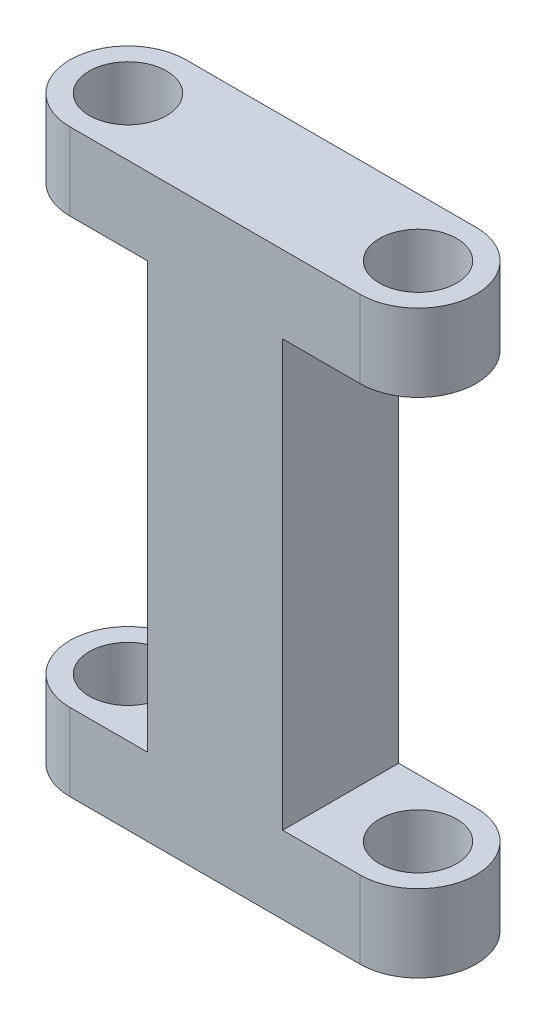
ISO-10303-21;
HEADER;
FILE_DESCRIPTION(('STEP AP214'),'2;1');
FILE_NAME('part.step','',(''),(''),'','','');
FILE_SCHEMA(('AUTOMOTIVE_DESIGN { 1 0 10303 214 1 1 1 1 }'));
ENDSEC;
DATA;
#1=APPLICATION_CONTEXT('core data for automotive mechanical design processes');
#2=APPLICATION_PROTOCOL_DEFINITION('international standard','automotive_design',2000,#1);
#3=PRODUCT_CONTEXT('',#1,'mechanical');
#4=PRODUCT('Part','Part','',(#3));
#5=PRODUCT_RELATED_PRODUCT_CATEGORY('part','',(#4));
#6=PRODUCT_DEFINITION_FORMATION('','',#4);
#7=PRODUCT_DEFINITION_CONTEXT('part definition',#1,'design');
#8=PRODUCT_DEFINITION('design','',#6,#7);
#9=PRODUCT_DEFINITION_SHAPE('','',#8);
#10=(LENGTH_UNIT() NAMED_UNIT(*) SI_UNIT(.MILLI.,.METRE.));
#11=(NAMED_UNIT(*) PLANE_ANGLE_UNIT() SI_UNIT($,.RADIAN.));
#12=(NAMED_UNIT(*) SI_UNIT($,.STERADIAN.) SOLID_ANGLE_UNIT());
#13=UNCERTAINTY_MEASURE_WITH_UNIT(LENGTH_MEASURE(1.E-05),#10,'distance_accuracy_value','');
#14=(GEOMETRIC_REPRESENTATION_CONTEXT(3) GLOBAL_UNCERTAINTY_ASSIGNED_CONTEXT((#13)) GLOBAL_UNIT_ASSIGNED_CONTEXT((#10,
#11,#12)) REPRESENTATION_CONTEXT('',''));
#15=CARTESIAN_POINT('',(0.,0.,0.));
#16=DIRECTION('',(0.,0.,1.));
#17=DIRECTION('',(1.,0.,0.));
#18=AXIS2_PLACEMENT_3D('',#15,#16,#17);
#19=CARTESIAN_POINT('',(-8.53932584269664,30.,0.));
#20=DIRECTION('',(0.,-1.,0.));
#21=DIRECTION('',(0.,0.,-1.));
#22=AXIS2_PLACEMENT_3D('',#19,#20,#21);
#23=CYLINDRICAL_SURFACE('',#22,3.);
#24=DIRECTION('',(0.,-1.,0.));
#25=VECTOR('',#24,1.);
#26=CARTESIAN_POINT('',(-8.53932584269664,30.,-3.));
#27=LINE('',#26,#25);
#28=CARTESIAN_POINT('',(-8.53932584269664,30.,-3.));
#29=VERTEX_POINT('',#28);
#30=CARTESIAN_POINT('',(-8.53932584269664,26.,-3.));
#31=VERTEX_POINT('',#30);
#32=EDGE_CURVE('E139',#29,#31,#27,.T.);
#33=ORIENTED_EDGE('',*,*,#32,.T.);
#34=CARTESIAN_POINT('',(-8.53932584269664,26.,0.));
#35=DIRECTION('',(0.,1.,0.));
#36=DIRECTION('',(0.,0.,1.));
#37=AXIS2_PLACEMENT_3D('',#34,#35,#36);
#38=CIRCLE('',#37,3.);
#39=CARTESIAN_POINT('',(-8.53932584269664,26.,3.));
#40=VERTEX_POINT('',#39);
#41=EDGE_CURVE('E125',#40,#31,#38,.F.);
#42=ORIENTED_EDGE('',*,*,#41,.F.);
#43=DIRECTION('',(0.,-1.,0.));
#44=VECTOR('',#43,1.);
#45=CARTESIAN_POINT('',(-8.53932584269664,30.,3.));
#46=LINE('',#45,#44);
#47=CARTESIAN_POINT('',(-8.53932584269664,30.,3.));
#48=VERTEX_POINT('',#47);
#49=EDGE_CURVE('E11',#48,#40,#46,.T.);
#50=ORIENTED_EDGE('',*,*,#49,.F.);
#51=CARTESIAN_POINT('',(-8.53932584269664,30.,0.));
#52=DIRECTION('',(0.,1.,0.));
#53=DIRECTION('',(0.,0.,1.));
#54=AXIS2_PLACEMENT_3D('',#51,#52,#53);
#55=CIRCLE('',#54,3.);
#56=EDGE_CURVE('E153',#29,#48,#55,.T.);
#57=ORIENTED_EDGE('',*,*,#56,.F.);
#58=EDGE_LOOP('',(#33,#42,#50,#57));
#59=FACE_BOUND('',#58,.T.);
#60=ADVANCED_FACE('F33',(#59),#23,.T.);
#61=CARTESIAN_POINT('',(-8.53932584269664,30.,0.));
#62=DIRECTION('',(0.,-1.,0.));
#63=DIRECTION('',(0.,0.,-1.));
#64=AXIS2_PLACEMENT_3D('',#61,#62,#63);
#65=CYLINDRICAL_SURFACE('',#64,2.);
#66=CARTESIAN_POINT('',(-8.53932584269664,26.,0.));
#67=DIRECTION('',(0.,1.,0.));
#68=DIRECTION('',(0.,0.,1.));
#69=AXIS2_PLACEMENT_3D('',#66,#67,#68);
#70=CIRCLE('',#69,2.);
#71=CARTESIAN_POINT('',(-8.53932584269664,26.,2.));
#72=VERTEX_POINT('',#71);
#73=EDGE_CURVE('E281',#72,#72,#70,.F.);
#74=ORIENTED_EDGE('',*,*,#73,.T.);
#75=EDGE_LOOP('',(#74));
#76=FACE_BOUND('',#75,.T.);
#77=CARTESIAN_POINT('',(-8.53932584269664,30.,0.));
#78=DIRECTION('',(0.,1.,0.));
#79=DIRECTION('',(0.,0.,1.));
#80=AXIS2_PLACEMENT_3D('',#77,#78,#79);
#81=CIRCLE('',#80,2.);
#82=CARTESIAN_POINT('',(-8.53932584269664,30.,2.));
#83=VERTEX_POINT('',#82);
#84=EDGE_CURVE('E175',#83,#83,#81,.T.);
#85=ORIENTED_EDGE('',*,*,#84,.T.);
#86=EDGE_LOOP('',(#85));
#87=FACE_BOUND('',#86,.T.);
#88=ADVANCED_FACE('F251',(#76,#87),#65,.F.);
#89=CARTESIAN_POINT('',(6.46067415730336,30.,0.));
#90=DIRECTION('',(0.,-1.,0.));
#91=DIRECTION('',(0.,0.,-1.));
#92=AXIS2_PLACEMENT_3D('',#89,#90,#91);
#93=CYLINDRICAL_SURFACE('',#92,3.);
#94=DIRECTION('',(0.,-1.,0.));
#95=VECTOR('',#94,1.);
#96=CARTESIAN_POINT('',(6.46067415730336,30.,-3.));
#97=LINE('',#96,#95);
#98=CARTESIAN_POINT('',(6.46067415730336,4.,-3.));
#99=VERTEX_POINT('',#98);
#100=CARTESIAN_POINT('',(6.46067415730336,0.,-3.));
#101=VERTEX_POINT('',#100);
#102=EDGE_CURVE('E181',#99,#101,#97,.T.);
#103=ORIENTED_EDGE('',*,*,#102,.F.);
#104=CARTESIAN_POINT('',(6.46067415730336,4.,0.));
#105=DIRECTION('',(0.,-1.,0.));
#106=DIRECTION('',(1.,0.,0.));
#107=AXIS2_PLACEMENT_3D('',#104,#105,#106);
#108=CIRCLE('',#107,3.);
#109=CARTESIAN_POINT('',(6.46067415730336,4.,3.));
#110=VERTEX_POINT('',#109);
#111=EDGE_CURVE('E194',#110,#99,#108,.F.);
#112=ORIENTED_EDGE('',*,*,#111,.F.);
#113=DIRECTION('',(0.,-1.,0.));
#114=VECTOR('',#113,1.);
#115=CARTESIAN_POINT('',(6.46067415730336,30.,3.));
#116=LINE('',#115,#114);
#117=CARTESIAN_POINT('',(6.46067415730336,0.,3.));
#118=VERTEX_POINT('',#117);
#119=EDGE_CURVE('E184',#110,#118,#116,.T.);
#120=ORIENTED_EDGE('',*,*,#119,.T.);
#121=CARTESIAN_POINT('',(6.46067415730336,0.,0.));
#122=DIRECTION('',(0.,1.,0.));
#123=DIRECTION('',(0.,0.,1.));
#124=AXIS2_PLACEMENT_3D('',#121,#122,#123);
#125=CIRCLE('',#124,3.);
#126=EDGE_CURVE('E162',#118,#101,#125,.T.);
#127=ORIENTED_EDGE('',*,*,#126,.T.);
#128=EDGE_LOOP('',(#103,#112,#120,#127));
#129=FACE_BOUND('',#128,.T.);
#130=ADVANCED_FACE('F191',(#129),#93,.T.);
#131=CARTESIAN_POINT('',(6.46067415730336,30.,0.));
#132=DIRECTION('',(0.,-1.,0.));
#133=DIRECTION('',(0.,0.,-1.));
#134=AXIS2_PLACEMENT_3D('',#131,#132,#133);
#135=CYLINDRICAL_SURFACE('',#134,2.);
#136=CARTESIAN_POINT('',(6.46067415730336,4.,0.));
#137=DIRECTION('',(0.,-1.,0.));
#138=DIRECTION('',(1.,0.,0.));
#139=AXIS2_PLACEMENT_3D('',#136,#137,#138);
#140=CIRCLE('',#139,2.);
#141=CARTESIAN_POINT('',(8.46067415730336,4.,0.));
#142=VERTEX_POINT('',#141);
#143=EDGE_CURVE('E218',#142,#142,#140,.F.);
#144=ORIENTED_EDGE('',*,*,#143,.T.);
#145=EDGE_LOOP('',(#144));
#146=FACE_BOUND('',#145,.T.);
#147=CARTESIAN_POINT('',(6.46067415730336,0.,0.));
#148=DIRECTION('',(0.,1.,0.));
#149=DIRECTION('',(0.,0.,1.));
#150=AXIS2_PLACEMENT_3D('',#147,#148,#149);
#151=CIRCLE('',#150,2.);
#152=CARTESIAN_POINT('',(6.46067415730336,0.,2.));
#153=VERTEX_POINT('',#152);
#154=EDGE_CURVE('E234',#153,#153,#151,.T.);
#155=ORIENTED_EDGE('',*,*,#154,.F.);
#156=EDGE_LOOP('',(#155));
#157=FACE_BOUND('',#156,.T.);
#158=ADVANCED_FACE('F259',(#146,#157),#135,.F.);
#159=CARTESIAN_POINT('',(-8.53932584269664,30.,0.));
#160=DIRECTION('',(0.,1.,0.));
#161=DIRECTION('',(0.,0.,1.));
#162=AXIS2_PLACEMENT_3D('',#159,#160,#161);
#163=PLANE('',#162);
#164=ORIENTED_EDGE('',*,*,#84,.F.);
#165=EDGE_LOOP('',(#164));
#166=FACE_BOUND('',#165,.T.);
#167=ORIENTED_EDGE('',*,*,#56,.T.);
#168=DIRECTION('',(1.,0.,0.));
#169=VECTOR('',#168,1.);
#170=CARTESIAN_POINT('',(-8.53932584269664,30.,3.));
#171=LINE('',#170,#169);
#172=CARTESIAN_POINT('',(6.46067415730336,30.,3.));
#173=VERTEX_POINT('',#172);
#174=EDGE_CURVE('E145',#48,#173,#171,.T.);
#175=ORIENTED_EDGE('',*,*,#174,.T.);
#176=CARTESIAN_POINT('',(6.46067415730336,30.,0.));
#177=DIRECTION('',(0.,1.,0.));
#178=DIRECTION('',(0.,0.,1.));
#179=AXIS2_PLACEMENT_3D('',#176,#177,#178);
#180=CIRCLE('',#179,3.);
#181=CARTESIAN_POINT('',(6.46067415730336,30.,-3.));
#182=VERTEX_POINT('',#181);
#183=EDGE_CURVE('E152',#173,#182,#180,.T.);
#184=ORIENTED_EDGE('',*,*,#183,.T.);
#185=DIRECTION('',(-1.,0.,0.));
#186=VECTOR('',#185,1.);
#187=CARTESIAN_POINT('',(-8.53932584269664,30.,-3.));
#188=LINE('',#187,#186);
#189=EDGE_CURVE('E158',#182,#29,#188,.T.);
#190=ORIENTED_EDGE('',*,*,#189,.T.);
#191=EDGE_LOOP('',(#167,#175,#184,#190));
#192=FACE_BOUND('',#191,.T.);
#193=CARTESIAN_POINT('',(6.46067415730336,30.,0.));
#194=DIRECTION('',(0.,1.,0.));
#195=DIRECTION('',(0.,0.,1.));
#196=AXIS2_PLACEMENT_3D('',#193,#194,#195);
#197=CIRCLE('',#196,2.);
#198=CARTESIAN_POINT('',(6.46067415730336,30.,2.));
#199=VERTEX_POINT('',#198);
#200=EDGE_CURVE('E235',#199,#199,#197,.T.);
#201=ORIENTED_EDGE('',*,*,#200,.F.);
#202=EDGE_LOOP('',(#201));
#203=FACE_BOUND('',#202,.T.);
#204=ADVANCED_FACE('F155',(#166,#192,#203),#163,.T.);
#205=CARTESIAN_POINT('',(-8.53932584269664,0.,0.));
#206=DIRECTION('',(0.,1.,0.));
#207=DIRECTION('',(0.,0.,1.));
#208=AXIS2_PLACEMENT_3D('',#205,#206,#207);
#209=PLANE('',#208);
#210=CARTESIAN_POINT('',(-8.53932584269664,0.,0.));
#211=DIRECTION('',(0.,1.,0.));
#212=DIRECTION('',(0.,0.,1.));
#213=AXIS2_PLACEMENT_3D('',#210,#211,#212);
#214=CIRCLE('',#213,2.);
#215=CARTESIAN_POINT('',(-8.53932584269664,0.,2.));
#216=VERTEX_POINT('',#215);
#217=EDGE_CURVE('E165',#216,#216,#214,.T.);
#218=ORIENTED_EDGE('',*,*,#217,.T.);
#219=EDGE_LOOP('',(#218));
#220=FACE_BOUND('',#219,.T.);
#221=CARTESIAN_POINT('',(-8.53932584269664,0.,0.));
#222=DIRECTION('',(0.,1.,0.));
#223=DIRECTION('',(0.,0.,1.));
#224=AXIS2_PLACEMENT_3D('',#221,#222,#223);
#225=CIRCLE('',#224,3.);
#226=CARTESIAN_POINT('',(-8.53932584269664,0.,-3.));
#227=VERTEX_POINT('',#226);
#228=CARTESIAN_POINT('',(-8.53932584269664,0.,3.));
#229=VERTEX_POINT('',#228);
#230=EDGE_CURVE('E171',#227,#229,#225,.T.);
#231=ORIENTED_EDGE('',*,*,#230,.F.);
#232=DIRECTION('',(-1.,0.,0.));
#233=VECTOR('',#232,1.);
#234=CARTESIAN_POINT('',(-8.53932584269664,0.,-3.));
#235=LINE('',#234,#233);
#236=EDGE_CURVE('E159',#101,#227,#235,.T.);
#237=ORIENTED_EDGE('',*,*,#236,.F.);
#238=ORIENTED_EDGE('',*,*,#126,.F.);
#239=DIRECTION('',(1.,0.,0.));
#240=VECTOR('',#239,1.);
#241=CARTESIAN_POINT('',(-8.53932584269664,0.,3.));
#242=LINE('',#241,#240);
#243=EDGE_CURVE('E174',#229,#118,#242,.T.);
#244=ORIENTED_EDGE('',*,*,#243,.F.);
#245=EDGE_LOOP('',(#231,#237,#238,#244));
#246=FACE_BOUND('',#245,.T.);
#247=ORIENTED_EDGE('',*,*,#154,.T.);
#248=EDGE_LOOP('',(#247));
#249=FACE_BOUND('',#248,.T.);
#250=ADVANCED_FACE('F201',(#220,#246,#249),#209,.F.);
#251=CARTESIAN_POINT('',(-8.53932584269664,4.,3.));
#252=VERTEX_POINT('',#251);
#253=EDGE_CURVE('E41',#252,#229,#46,.T.);
#254=ORIENTED_EDGE('',*,*,#253,.F.);
#255=CARTESIAN_POINT('',(-8.53932584269664,4.,0.));
#256=DIRECTION('',(0.,-1.,0.));
#257=DIRECTION('',(0.,0.,-1.));
#258=AXIS2_PLACEMENT_3D('',#255,#256,#257);
#259=CIRCLE('',#258,3.);
#260=CARTESIAN_POINT('',(-8.53932584269664,4.,-3.));
#261=VERTEX_POINT('',#260);
#262=EDGE_CURVE('E141',#261,#252,#259,.F.);
#263=ORIENTED_EDGE('',*,*,#262,.F.);
#264=EDGE_CURVE('E170',#261,#227,#27,.T.);
#265=ORIENTED_EDGE('',*,*,#264,.T.);
#266=ORIENTED_EDGE('',*,*,#230,.T.);
#267=EDGE_LOOP('',(#254,#263,#265,#266));
#268=FACE_BOUND('',#267,.T.);
#269=ADVANCED_FACE('F35',(#268),#23,.T.);
#270=CARTESIAN_POINT('',(-8.53932584269664,30.,3.));
#271=DIRECTION('',(0.,0.,-1.));
#272=DIRECTION('',(-1.,0.,0.));
#273=AXIS2_PLACEMENT_3D('',#270,#271,#272);
#274=PLANE('',#273);
#275=ORIENTED_EDGE('',*,*,#49,.T.);
#276=DIRECTION('',(-1.,0.,0.));
#277=VECTOR('',#276,1.);
#278=CARTESIAN_POINT('',(-11.5393258426966,26.,3.));
#279=LINE('',#278,#277);
#280=CARTESIAN_POINT('',(-4.53932584269664,26.,3.));
#281=VERTEX_POINT('',#280);
#282=EDGE_CURVE('E121',#281,#40,#279,.T.);
#283=ORIENTED_EDGE('',*,*,#282,.F.);
#284=DIRECTION('',(0.,1.,0.));
#285=VECTOR('',#284,1.);
#286=CARTESIAN_POINT('',(-4.53932584269664,26.,3.));
#287=LINE('',#286,#285);
#288=CARTESIAN_POINT('',(-4.53932584269664,4.,3.));
#289=VERTEX_POINT('',#288);
#290=EDGE_CURVE('E132',#289,#281,#287,.T.);
#291=ORIENTED_EDGE('',*,*,#290,.F.);
#292=DIRECTION('',(1.,0.,0.));
#293=VECTOR('',#292,1.);
#294=CARTESIAN_POINT('',(-11.5393258426966,4.,3.));
#295=LINE('',#294,#293);
#296=EDGE_CURVE('E287',#252,#289,#295,.T.);
#297=ORIENTED_EDGE('',*,*,#296,.F.);
#298=ORIENTED_EDGE('',*,*,#253,.T.);
#299=ORIENTED_EDGE('',*,*,#243,.T.);
#300=ORIENTED_EDGE('',*,*,#119,.F.);
#301=DIRECTION('',(1.,0.,0.));
#302=VECTOR('',#301,1.);
#303=CARTESIAN_POINT('',(9.46067415730336,4.,3.));
#304=LINE('',#303,#302);
#305=CARTESIAN_POINT('',(2.46067415730336,4.,3.));
#306=VERTEX_POINT('',#305);
#307=EDGE_CURVE('E224',#306,#110,#304,.T.);
#308=ORIENTED_EDGE('',*,*,#307,.F.);
#309=DIRECTION('',(0.,-1.,0.));
#310=VECTOR('',#309,1.);
#311=CARTESIAN_POINT('',(2.46067415730336,26.,3.));
#312=LINE('',#311,#310);
#313=CARTESIAN_POINT('',(2.46067415730336,26.,3.));
#314=VERTEX_POINT('',#313);
#315=EDGE_CURVE('E216',#314,#306,#312,.T.);
#316=ORIENTED_EDGE('',*,*,#315,.F.);
#317=DIRECTION('',(-1.,0.,0.));
#318=VECTOR('',#317,1.);
#319=CARTESIAN_POINT('',(9.46067415730336,26.,3.));
#320=LINE('',#319,#318);
#321=CARTESIAN_POINT('',(6.46067415730336,26.,3.));
#322=VERTEX_POINT('',#321);
#323=EDGE_CURVE('E214',#322,#314,#320,.T.);
#324=ORIENTED_EDGE('',*,*,#323,.F.);
#325=EDGE_CURVE('E149',#173,#322,#116,.T.);
#326=ORIENTED_EDGE('',*,*,#325,.F.);
#327=ORIENTED_EDGE('',*,*,#174,.F.);
#328=EDGE_LOOP('',(#275,#283,#291,#297,#298,#299,#300,#308,#316,#324,#326,#327));
#329=FACE_BOUND('',#328,.T.);
#330=ADVANCED_FACE('F143',(#329),#274,.F.);
#331=ORIENTED_EDGE('',*,*,#325,.T.);
#332=CARTESIAN_POINT('',(6.46067415730336,26.,0.));
#333=DIRECTION('',(0.,1.,0.));
#334=DIRECTION('',(0.,0.,1.));
#335=AXIS2_PLACEMENT_3D('',#332,#333,#334);
#336=CIRCLE('',#335,3.);
#337=CARTESIAN_POINT('',(6.46067415730336,26.,-3.));
#338=VERTEX_POINT('',#337);
#339=EDGE_CURVE('E295',#338,#322,#336,.F.);
#340=ORIENTED_EDGE('',*,*,#339,.F.);
#341=EDGE_CURVE('E182',#182,#338,#97,.T.);
#342=ORIENTED_EDGE('',*,*,#341,.F.);
#343=ORIENTED_EDGE('',*,*,#183,.F.);
#344=EDGE_LOOP('',(#331,#340,#342,#343));
#345=FACE_BOUND('',#344,.T.);
#346=ADVANCED_FACE('F260',(#345),#93,.T.);
#347=CARTESIAN_POINT('',(-8.53932584269664,30.,-3.));
#348=DIRECTION('',(0.,0.,1.));
#349=DIRECTION('',(1.,0.,0.));
#350=AXIS2_PLACEMENT_3D('',#347,#348,#349);
#351=PLANE('',#350);
#352=DIRECTION('',(0.,-1.,0.));
#353=VECTOR('',#352,1.);
#354=CARTESIAN_POINT('',(-4.53932584269664,26.,-3.));
#355=LINE('',#354,#353);
#356=CARTESIAN_POINT('',(-4.53932584269664,26.,-3.));
#357=VERTEX_POINT('',#356);
#358=CARTESIAN_POINT('',(-4.53932584269664,4.,-3.));
#359=VERTEX_POINT('',#358);
#360=EDGE_CURVE('E48',#357,#359,#355,.T.);
#361=ORIENTED_EDGE('',*,*,#360,.F.);
#362=DIRECTION('',(1.,0.,0.));
#363=VECTOR('',#362,1.);
#364=CARTESIAN_POINT('',(-11.5393258426966,26.,-3.));
#365=LINE('',#364,#363);
#366=EDGE_CURVE('E285',#31,#357,#365,.T.);
#367=ORIENTED_EDGE('',*,*,#366,.F.);
#368=ORIENTED_EDGE('',*,*,#32,.F.);
#369=ORIENTED_EDGE('',*,*,#189,.F.);
#370=ORIENTED_EDGE('',*,*,#341,.T.);
#371=DIRECTION('',(1.,0.,0.));
#372=VECTOR('',#371,1.);
#373=CARTESIAN_POINT('',(9.46067415730336,26.,-3.));
#374=LINE('',#373,#372);
#375=CARTESIAN_POINT('',(2.46067415730336,26.,-3.));
#376=VERTEX_POINT('',#375);
#377=EDGE_CURVE('E228',#376,#338,#374,.T.);
#378=ORIENTED_EDGE('',*,*,#377,.F.);
#379=DIRECTION('',(0.,1.,0.));
#380=VECTOR('',#379,1.);
#381=CARTESIAN_POINT('',(2.46067415730336,26.,-3.));
#382=LINE('',#381,#380);
#383=CARTESIAN_POINT('',(2.46067415730336,4.,-3.));
#384=VERTEX_POINT('',#383);
#385=EDGE_CURVE('E211',#384,#376,#382,.T.);
#386=ORIENTED_EDGE('',*,*,#385,.F.);
#387=DIRECTION('',(-1.,0.,0.));
#388=VECTOR('',#387,1.);
#389=CARTESIAN_POINT('',(9.46067415730336,4.,-3.));
#390=LINE('',#389,#388);
#391=EDGE_CURVE('E209',#99,#384,#390,.T.);
#392=ORIENTED_EDGE('',*,*,#391,.F.);
#393=ORIENTED_EDGE('',*,*,#102,.T.);
#394=ORIENTED_EDGE('',*,*,#236,.T.);
#395=ORIENTED_EDGE('',*,*,#264,.F.);
#396=DIRECTION('',(-1.,0.,0.));
#397=VECTOR('',#396,1.);
#398=CARTESIAN_POINT('',(-11.5393258426966,4.,-3.));
#399=LINE('',#398,#397);
#400=EDGE_CURVE('E291',#359,#261,#399,.T.);
#401=ORIENTED_EDGE('',*,*,#400,.F.);
#402=EDGE_LOOP('',(#361,#367,#368,#369,#370,#378,#386,#392,#393,#394,#395,#401));
#403=FACE_BOUND('',#402,.T.);
#404=ADVANCED_FACE('F205',(#403),#351,.F.);
#405=CARTESIAN_POINT('',(-8.53932584269664,4.,0.));
#406=DIRECTION('',(0.,-1.,0.));
#407=DIRECTION('',(0.,0.,-1.));
#408=AXIS2_PLACEMENT_3D('',#405,#406,#407);
#409=CIRCLE('',#408,2.);
#410=CARTESIAN_POINT('',(-8.53932584269664,4.,-2.));
#411=VERTEX_POINT('',#410);
#412=EDGE_CURVE('E140',#411,#411,#409,.F.);
#413=ORIENTED_EDGE('',*,*,#412,.T.);
#414=EDGE_LOOP('',(#413));
#415=FACE_BOUND('',#414,.T.);
#416=ORIENTED_EDGE('',*,*,#217,.F.);
#417=EDGE_LOOP('',(#416));
#418=FACE_BOUND('',#417,.T.);
#419=ADVANCED_FACE('F246',(#415,#418),#65,.F.);
#420=CARTESIAN_POINT('',(6.46067415730336,26.,0.));
#421=DIRECTION('',(0.,1.,0.));
#422=DIRECTION('',(0.,0.,1.));
#423=AXIS2_PLACEMENT_3D('',#420,#421,#422);
#424=CIRCLE('',#423,2.);
#425=CARTESIAN_POINT('',(6.46067415730336,26.,2.));
#426=VERTEX_POINT('',#425);
#427=EDGE_CURVE('E230',#426,#426,#424,.F.);
#428=ORIENTED_EDGE('',*,*,#427,.T.);
#429=EDGE_LOOP('',(#428));
#430=FACE_BOUND('',#429,.T.);
#431=ORIENTED_EDGE('',*,*,#200,.T.);
#432=EDGE_LOOP('',(#431));
#433=FACE_BOUND('',#432,.T.);
#434=ADVANCED_FACE('F248',(#430,#433),#135,.F.);
#435=CARTESIAN_POINT('',(9.46067415730336,4.,-3.001));
#436=DIRECTION('',(0.,-1.,0.));
#437=DIRECTION('',(1.,0.,0.));
#438=AXIS2_PLACEMENT_3D('',#435,#436,#437);
#439=PLANE('',#438);
#440=ORIENTED_EDGE('',*,*,#143,.F.);
#441=EDGE_LOOP('',(#440));
#442=FACE_BOUND('',#441,.T.);
#443=ORIENTED_EDGE('',*,*,#111,.T.);
#444=ORIENTED_EDGE('',*,*,#391,.T.);
#445=DIRECTION('',(0.,0.,1.));
#446=VECTOR('',#445,1.);
#447=CARTESIAN_POINT('',(2.46067415730336,4.,-3.001));
#448=LINE('',#447,#446);
#449=EDGE_CURVE('E226',#384,#306,#448,.T.);
#450=ORIENTED_EDGE('',*,*,#449,.T.);
#451=ORIENTED_EDGE('',*,*,#307,.T.);
#452=EDGE_LOOP('',(#443,#444,#450,#451));
#453=FACE_BOUND('',#452,.T.);
#454=ADVANCED_FACE('F256',(#442,#453),#439,.F.);
#455=CARTESIAN_POINT('',(2.46067415730336,26.,-3.001));
#456=DIRECTION('',(-1.,0.,0.));
#457=DIRECTION('',(0.,-1.,0.));
#458=AXIS2_PLACEMENT_3D('',#455,#456,#457);
#459=PLANE('',#458);
#460=ORIENTED_EDGE('',*,*,#385,.T.);
#461=DIRECTION('',(0.,0.,1.));
#462=VECTOR('',#461,1.);
#463=CARTESIAN_POINT('',(2.46067415730336,26.,-3.001));
#464=LINE('',#463,#462);
#465=EDGE_CURVE('E56',#376,#314,#464,.T.);
#466=ORIENTED_EDGE('',*,*,#465,.T.);
#467=ORIENTED_EDGE('',*,*,#315,.T.);
#468=ORIENTED_EDGE('',*,*,#449,.F.);
#469=EDGE_LOOP('',(#460,#466,#467,#468));
#470=FACE_BOUND('',#469,.T.);
#471=ADVANCED_FACE('F303',(#470),#459,.F.);
#472=CARTESIAN_POINT('',(9.46067415730336,26.,-3.001));
#473=DIRECTION('',(0.,1.,0.));
#474=DIRECTION('',(0.,0.,1.));
#475=AXIS2_PLACEMENT_3D('',#472,#473,#474);
#476=PLANE('',#475);
#477=ORIENTED_EDGE('',*,*,#427,.F.);
#478=EDGE_LOOP('',(#477));
#479=FACE_BOUND('',#478,.T.);
#480=ORIENTED_EDGE('',*,*,#323,.T.);
#481=ORIENTED_EDGE('',*,*,#465,.F.);
#482=ORIENTED_EDGE('',*,*,#377,.T.);
#483=ORIENTED_EDGE('',*,*,#339,.T.);
#484=EDGE_LOOP('',(#480,#481,#482,#483));
#485=FACE_BOUND('',#484,.T.);
#486=ADVANCED_FACE('F307',(#479,#485),#476,.F.);
#487=CARTESIAN_POINT('',(-11.5393258426966,26.,-3.001));
#488=DIRECTION('',(0.,1.,0.));
#489=DIRECTION('',(0.,0.,1.));
#490=AXIS2_PLACEMENT_3D('',#487,#488,#489);
#491=PLANE('',#490);
#492=ORIENTED_EDGE('',*,*,#73,.F.);
#493=EDGE_LOOP('',(#492));
#494=FACE_BOUND('',#493,.T.);
#495=ORIENTED_EDGE('',*,*,#41,.T.);
#496=ORIENTED_EDGE('',*,*,#366,.T.);
#497=DIRECTION('',(0.,0.,1.));
#498=VECTOR('',#497,1.);
#499=CARTESIAN_POINT('',(-4.53932584269664,26.,-3.001));
#500=LINE('',#499,#498);
#501=EDGE_CURVE('E127',#357,#281,#500,.T.);
#502=ORIENTED_EDGE('',*,*,#501,.T.);
#503=ORIENTED_EDGE('',*,*,#282,.T.);
#504=EDGE_LOOP('',(#495,#496,#502,#503));
#505=FACE_BOUND('',#504,.T.);
#506=ADVANCED_FACE('F123',(#494,#505),#491,.F.);
#507=CARTESIAN_POINT('',(-4.53932584269664,26.,-3.001));
#508=DIRECTION('',(1.,0.,0.));
#509=DIRECTION('',(0.,1.,0.));
#510=AXIS2_PLACEMENT_3D('',#507,#508,#509);
#511=PLANE('',#510);
#512=ORIENTED_EDGE('',*,*,#360,.T.);
#513=DIRECTION('',(0.,0.,1.));
#514=VECTOR('',#513,1.);
#515=CARTESIAN_POINT('',(-4.53932584269664,4.,-3.001));
#516=LINE('',#515,#514);
#517=EDGE_CURVE('E131',#359,#289,#516,.T.);
#518=ORIENTED_EDGE('',*,*,#517,.T.);
#519=ORIENTED_EDGE('',*,*,#290,.T.);
#520=ORIENTED_EDGE('',*,*,#501,.F.);
#521=EDGE_LOOP('',(#512,#518,#519,#520));
#522=FACE_BOUND('',#521,.T.);
#523=ADVANCED_FACE('F310',(#522),#511,.F.);
#524=CARTESIAN_POINT('',(-11.5393258426966,4.,-3.001));
#525=DIRECTION('',(0.,-1.,0.));
#526=DIRECTION('',(0.,0.,-1.));
#527=AXIS2_PLACEMENT_3D('',#524,#525,#526);
#528=PLANE('',#527);
#529=ORIENTED_EDGE('',*,*,#412,.F.);
#530=EDGE_LOOP('',(#529));
#531=FACE_BOUND('',#530,.T.);
#532=ORIENTED_EDGE('',*,*,#262,.T.);
#533=ORIENTED_EDGE('',*,*,#296,.T.);
#534=ORIENTED_EDGE('',*,*,#517,.F.);
#535=ORIENTED_EDGE('',*,*,#400,.T.);
#536=EDGE_LOOP('',(#532,#533,#534,#535));
#537=FACE_BOUND('',#536,.T.);
#538=ADVANCED_FACE('F309',(#531,#537),#528,.F.);
#539=CLOSED_SHELL('',(#60,#88,#130,#158,#204,#250,#269,#330,#346,#404,#419,#434,#454,#471,#486,
#506,#523,#538));
#540=MANIFOLD_SOLID_BREP('B2',#539);
#541=ADVANCED_BREP_SHAPE_REPRESENTATION('',(#18,#540),#14);
#542=SHAPE_DEFINITION_REPRESENTATION(#9,#541);
ENDSEC;
END-ISO-10303-21;
